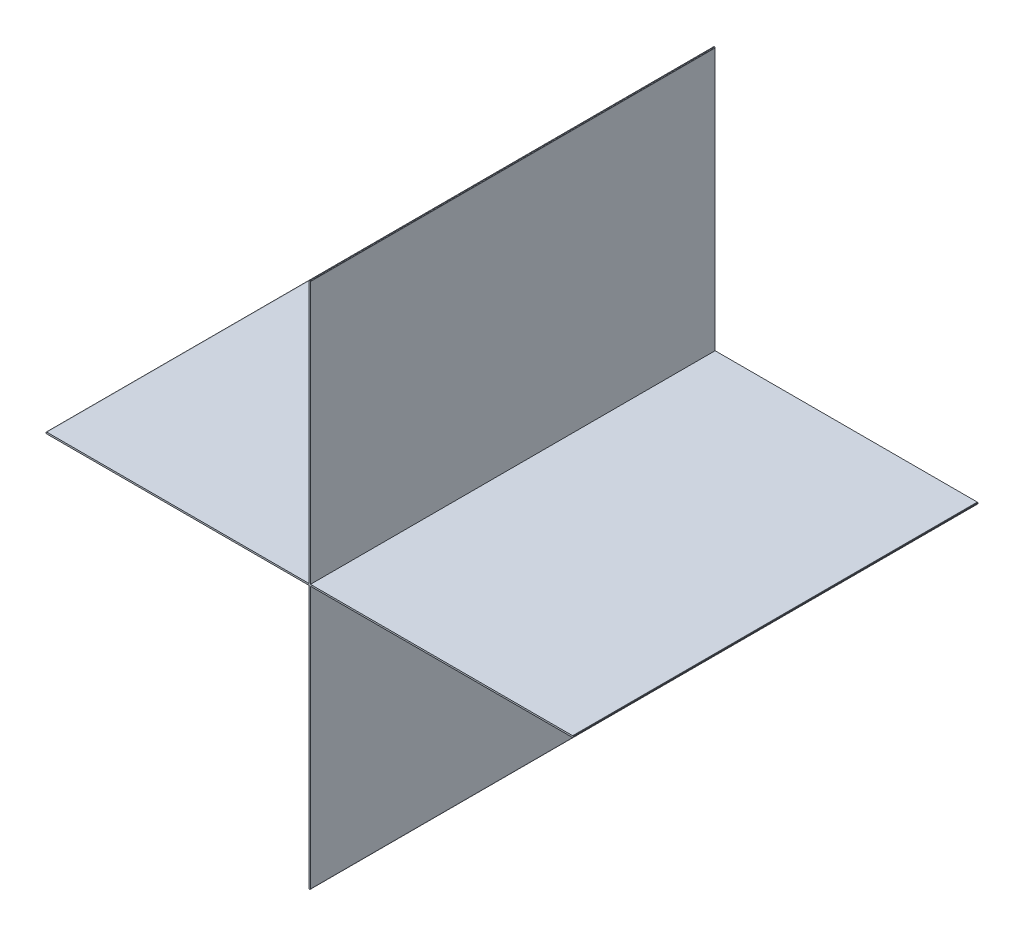
ISO-10303-21;
HEADER;
FILE_DESCRIPTION(('STEP AP214'),'2;1');
FILE_NAME('part.step','',(''),(''),'','','');
FILE_SCHEMA(('AUTOMOTIVE_DESIGN { 1 0 10303 214 1 1 1 1 }'));
ENDSEC;
DATA;
#1=APPLICATION_CONTEXT('core data for automotive mechanical design processes');
#2=APPLICATION_PROTOCOL_DEFINITION('international standard','automotive_design',2000,#1);
#3=PRODUCT_CONTEXT('',#1,'mechanical');
#4=PRODUCT('Part','Part','',(#3));
#5=PRODUCT_RELATED_PRODUCT_CATEGORY('part','',(#4));
#6=PRODUCT_DEFINITION_FORMATION('','',#4);
#7=PRODUCT_DEFINITION_CONTEXT('part definition',#1,'design');
#8=PRODUCT_DEFINITION('design','',#6,#7);
#9=PRODUCT_DEFINITION_SHAPE('','',#8);
#10=(LENGTH_UNIT() NAMED_UNIT(*) SI_UNIT(.MILLI.,.METRE.));
#11=(NAMED_UNIT(*) PLANE_ANGLE_UNIT() SI_UNIT($,.RADIAN.));
#12=(NAMED_UNIT(*) SI_UNIT($,.STERADIAN.) SOLID_ANGLE_UNIT());
#13=UNCERTAINTY_MEASURE_WITH_UNIT(LENGTH_MEASURE(1.E-05),#10,'distance_accuracy_value','');
#14=(GEOMETRIC_REPRESENTATION_CONTEXT(3) GLOBAL_UNCERTAINTY_ASSIGNED_CONTEXT((#13)) GLOBAL_UNIT_ASSIGNED_CONTEXT((#10,
#11,#12)) REPRESENTATION_CONTEXT('',''));
#15=CARTESIAN_POINT('',(0.,0.,0.));
#16=DIRECTION('',(0.,0.,1.));
#17=DIRECTION('',(1.,0.,0.));
#18=AXIS2_PLACEMENT_3D('',#15,#16,#17);
#19=CARTESIAN_POINT('',(-0.1649984,0.0005079999999964,0.));
#20=DIRECTION('',(0.,-1.,0.));
#21=DIRECTION('',(-1.,0.,0.));
#22=AXIS2_PLACEMENT_3D('',#19,#20,#21);
#23=PLANE('',#22);
#24=DIRECTION('',(-1.,0.,0.));
#25=VECTOR('',#24,1.);
#26=CARTESIAN_POINT('',(-0.1649984,0.0005079999999964,0.));
#27=LINE('',#26,#25);
#28=CARTESIAN_POINT('',(-0.1649984,0.0005079999999964,0.));
#29=VERTEX_POINT('',#28);
#30=CARTESIAN_POINT('',(-0.16520922,0.0005079999999964,0.));
#31=VERTEX_POINT('',#30);
#32=EDGE_CURVE('E11',#29,#31,#27,.T.);
#33=ORIENTED_EDGE('',*,*,#32,.T.);
#34=DIRECTION('',(0.,0.,1.));
#35=VECTOR('',#34,1.);
#36=CARTESIAN_POINT('',(-0.16520922,0.0005079999999964,0.));
#37=LINE('',#36,#35);
#38=CARTESIAN_POINT('',(-0.16520922,0.0005079999999964,0.254));
#39=VERTEX_POINT('',#38);
#40=EDGE_CURVE('E24',#31,#39,#37,.T.);
#41=ORIENTED_EDGE('',*,*,#40,.T.);
#42=DIRECTION('',(-1.,0.,0.));
#43=VECTOR('',#42,1.);
#44=CARTESIAN_POINT('',(-0.1649984,0.0005079999999964,0.254));
#45=LINE('',#44,#43);
#46=CARTESIAN_POINT('',(-0.1649984,0.0005079999999964,0.254));
#47=VERTEX_POINT('',#46);
#48=EDGE_CURVE('E494',#47,#39,#45,.T.);
#49=ORIENTED_EDGE('',*,*,#48,.F.);
#50=DIRECTION('',(0.,0.,1.));
#51=VECTOR('',#50,1.);
#52=CARTESIAN_POINT('',(-0.1649984,0.0005079999999964,0.));
#53=LINE('',#52,#51);
#54=EDGE_CURVE('E36',#29,#47,#53,.T.);
#55=ORIENTED_EDGE('',*,*,#54,.F.);
#56=EDGE_LOOP('',(#33,#41,#49,#55));
#57=FACE_BOUND('',#56,.T.);
#58=ADVANCED_FACE('F17',(#57),#23,.F.);
#59=CARTESIAN_POINT('',(-0.16520922,0.0005079999999964,0.));
#60=DIRECTION('',(0.710109317017189,-0.704091441423187,0.));
#61=DIRECTION('',(-0.704091441423187,-0.710109317017189,0.));
#62=AXIS2_PLACEMENT_3D('',#59,#60,#61);
#63=PLANE('',#62);
#64=DIRECTION('',(-0.704091441423187,-0.710109317017189,0.));
#65=VECTOR('',#64,1.);
#66=CARTESIAN_POINT('',(-0.16520922,0.0005079999999964,0.));
#67=LINE('',#66,#65);
#68=CARTESIAN_POINT('',(-0.1655064,0.0002082799999954,0.));
#69=VERTEX_POINT('',#68);
#70=EDGE_CURVE('E491',#31,#69,#67,.T.);
#71=ORIENTED_EDGE('',*,*,#70,.T.);
#72=DIRECTION('',(0.,0.,1.));
#73=VECTOR('',#72,1.);
#74=CARTESIAN_POINT('',(-0.1655064,0.0002082799999954,0.));
#75=LINE('',#74,#73);
#76=CARTESIAN_POINT('',(-0.1655064,0.0002082799999954,0.254));
#77=VERTEX_POINT('',#76);
#78=EDGE_CURVE('E488',#69,#77,#75,.T.);
#79=ORIENTED_EDGE('',*,*,#78,.T.);
#80=DIRECTION('',(-0.704091441423187,-0.710109317017189,0.));
#81=VECTOR('',#80,1.);
#82=CARTESIAN_POINT('',(-0.16520922,0.0005079999999964,0.254));
#83=LINE('',#82,#81);
#84=EDGE_CURVE('E486',#39,#77,#83,.T.);
#85=ORIENTED_EDGE('',*,*,#84,.F.);
#86=ORIENTED_EDGE('',*,*,#40,.F.);
#87=EDGE_LOOP('',(#71,#79,#85,#86));
#88=FACE_BOUND('',#87,.T.);
#89=ADVANCED_FACE('F496',(#88),#63,.F.);
#90=CARTESIAN_POINT('',(-0.1655064,0.0002082799999954,0.));
#91=DIRECTION('',(1.,0.,0.));
#92=DIRECTION('',(0.,-1.,0.));
#93=AXIS2_PLACEMENT_3D('',#90,#91,#92);
#94=PLANE('',#93);
#95=DIRECTION('',(0.,-1.,0.));
#96=VECTOR('',#95,1.);
#97=CARTESIAN_POINT('',(-0.1655064,0.0002082799999954,0.));
#98=LINE('',#97,#96);
#99=CARTESIAN_POINT('',(-0.1655064,-0.0002108200000031,0.));
#100=VERTEX_POINT('',#99);
#101=EDGE_CURVE('E483',#69,#100,#98,.T.);
#102=ORIENTED_EDGE('',*,*,#101,.T.);
#103=DIRECTION('',(0.,0.,1.));
#104=VECTOR('',#103,1.);
#105=CARTESIAN_POINT('',(-0.1655064,-0.0002108200000031,0.));
#106=LINE('',#105,#104);
#107=CARTESIAN_POINT('',(-0.1655064,-0.0002108200000031,0.254));
#108=VERTEX_POINT('',#107);
#109=EDGE_CURVE('E480',#100,#108,#106,.T.);
#110=ORIENTED_EDGE('',*,*,#109,.T.);
#111=DIRECTION('',(0.,-1.,0.));
#112=VECTOR('',#111,1.);
#113=CARTESIAN_POINT('',(-0.1655064,0.0002082799999954,0.254));
#114=LINE('',#113,#112);
#115=EDGE_CURVE('E478',#77,#108,#114,.T.);
#116=ORIENTED_EDGE('',*,*,#115,.F.);
#117=ORIENTED_EDGE('',*,*,#78,.F.);
#118=EDGE_LOOP('',(#102,#110,#116,#117));
#119=FACE_BOUND('',#118,.T.);
#120=ADVANCED_FACE('F500',(#119),#94,.F.);
#121=CARTESIAN_POINT('',(-0.1655064,-0.0002108200000031,0.));
#122=DIRECTION('',(0.707106781199048,0.707106781174048,0.));
#123=DIRECTION('',(0.707106781174048,-0.707106781199048,0.));
#124=AXIS2_PLACEMENT_3D('',#121,#122,#123);
#125=PLANE('',#124);
#126=DIRECTION('',(0.707106781174048,-0.707106781199048,0.));
#127=VECTOR('',#126,1.);
#128=CARTESIAN_POINT('',(-0.1655064,-0.0002108200000031,0.));
#129=LINE('',#128,#127);
#130=CARTESIAN_POINT('',(-0.16520922,-0.0005080000000035,0.));
#131=VERTEX_POINT('',#130);
#132=EDGE_CURVE('E475',#100,#131,#129,.T.);
#133=ORIENTED_EDGE('',*,*,#132,.T.);
#134=DIRECTION('',(0.,0.,1.));
#135=VECTOR('',#134,1.);
#136=CARTESIAN_POINT('',(-0.16520922,-0.0005080000000035,0.));
#137=LINE('',#136,#135);
#138=CARTESIAN_POINT('',(-0.16520922,-0.0005080000000035,0.254));
#139=VERTEX_POINT('',#138);
#140=EDGE_CURVE('E472',#131,#139,#137,.T.);
#141=ORIENTED_EDGE('',*,*,#140,.T.);
#142=DIRECTION('',(0.707106781174048,-0.707106781199048,0.));
#143=VECTOR('',#142,1.);
#144=CARTESIAN_POINT('',(-0.1655064,-0.0002108200000031,0.254));
#145=LINE('',#144,#143);
#146=EDGE_CURVE('E470',#108,#139,#145,.T.);
#147=ORIENTED_EDGE('',*,*,#146,.F.);
#148=ORIENTED_EDGE('',*,*,#109,.F.);
#149=EDGE_LOOP('',(#133,#141,#147,#148));
#150=FACE_BOUND('',#149,.T.);
#151=ADVANCED_FACE('F504',(#150),#125,.F.);
#152=CARTESIAN_POINT('',(-0.16520922,-0.0005080000000035,0.));
#153=DIRECTION('',(0.,1.,0.));
#154=DIRECTION('',(1.,0.,0.));
#155=AXIS2_PLACEMENT_3D('',#152,#153,#154);
#156=PLANE('',#155);
#157=DIRECTION('',(1.,0.,0.));
#158=VECTOR('',#157,1.);
#159=CARTESIAN_POINT('',(-0.16520922,-0.0005080000000035,0.));
#160=LINE('',#159,#158);
#161=CARTESIAN_POINT('',(-0.1649984,-0.0005080000000035,0.));
#162=VERTEX_POINT('',#161);
#163=EDGE_CURVE('E467',#131,#162,#160,.T.);
#164=ORIENTED_EDGE('',*,*,#163,.T.);
#165=DIRECTION('',(0.,0.,1.));
#166=VECTOR('',#165,1.);
#167=CARTESIAN_POINT('',(-0.1649984,-0.0005080000000035,0.));
#168=LINE('',#167,#166);
#169=CARTESIAN_POINT('',(-0.1649984,-0.0005080000000035,0.254));
#170=VERTEX_POINT('',#169);
#171=EDGE_CURVE('E464',#162,#170,#168,.T.);
#172=ORIENTED_EDGE('',*,*,#171,.T.);
#173=DIRECTION('',(1.,0.,0.));
#174=VECTOR('',#173,1.);
#175=CARTESIAN_POINT('',(-0.16520922,-0.0005080000000035,0.254));
#176=LINE('',#175,#174);
#177=EDGE_CURVE('E462',#139,#170,#176,.T.);
#178=ORIENTED_EDGE('',*,*,#177,.F.);
#179=ORIENTED_EDGE('',*,*,#140,.F.);
#180=EDGE_LOOP('',(#164,#172,#178,#179));
#181=FACE_BOUND('',#180,.T.);
#182=ADVANCED_FACE('F508',(#181),#156,.F.);
#183=CARTESIAN_POINT('',(-0.1649984,-0.0005080000000035,0.));
#184=DIRECTION('',(0.,1.,0.));
#185=DIRECTION('',(1.,0.,0.));
#186=AXIS2_PLACEMENT_3D('',#183,#184,#185);
#187=PLANE('',#186);
#188=DIRECTION('',(1.,0.,0.));
#189=VECTOR('',#188,1.);
#190=CARTESIAN_POINT('',(-0.1649984,-0.0005080000000035,0.));
#191=LINE('',#190,#189);
#192=CARTESIAN_POINT('',(-0.0005080000000106,-0.0005080000000035,0.));
#193=VERTEX_POINT('',#192);
#194=EDGE_CURVE('E459',#162,#193,#191,.T.);
#195=ORIENTED_EDGE('',*,*,#194,.T.);
#196=DIRECTION('',(0.,0.,1.));
#197=VECTOR('',#196,1.);
#198=CARTESIAN_POINT('',(-0.0005080000000106,-0.0005080000000035,0.));
#199=LINE('',#198,#197);
#200=CARTESIAN_POINT('',(-0.0005080000000106,-0.0005080000000035,0.254));
#201=VERTEX_POINT('',#200);
#202=EDGE_CURVE('E456',#193,#201,#199,.T.);
#203=ORIENTED_EDGE('',*,*,#202,.T.);
#204=DIRECTION('',(1.,0.,0.));
#205=VECTOR('',#204,1.);
#206=CARTESIAN_POINT('',(-0.1649984,-0.0005080000000035,0.254));
#207=LINE('',#206,#205);
#208=EDGE_CURVE('E454',#170,#201,#207,.T.);
#209=ORIENTED_EDGE('',*,*,#208,.F.);
#210=ORIENTED_EDGE('',*,*,#171,.F.);
#211=EDGE_LOOP('',(#195,#203,#209,#210));
#212=FACE_BOUND('',#211,.T.);
#213=ADVANCED_FACE('F512',(#212),#187,.F.);
#214=CARTESIAN_POINT('',(-0.0005080000000106,-0.0005080000000035,0.));
#215=DIRECTION('',(1.,0.,0.));
#216=DIRECTION('',(0.,-1.,0.));
#217=AXIS2_PLACEMENT_3D('',#214,#215,#216);
#218=PLANE('',#217);
#219=DIRECTION('',(0.,-1.,0.));
#220=VECTOR('',#219,1.);
#221=CARTESIAN_POINT('',(-0.0005080000000106,-0.0005080000000035,0.));
#222=LINE('',#221,#220);
#223=CARTESIAN_POINT('',(-0.0005080000000106,-0.16500094,0.));
#224=VERTEX_POINT('',#223);
#225=EDGE_CURVE('E451',#193,#224,#222,.T.);
#226=ORIENTED_EDGE('',*,*,#225,.T.);
#227=DIRECTION('',(0.,0.,1.));
#228=VECTOR('',#227,1.);
#229=CARTESIAN_POINT('',(-0.0005080000000106,-0.16500094,0.));
#230=LINE('',#229,#228);
#231=CARTESIAN_POINT('',(-0.0005080000000106,-0.16500094,0.254));
#232=VERTEX_POINT('',#231);
#233=EDGE_CURVE('E448',#224,#232,#230,.T.);
#234=ORIENTED_EDGE('',*,*,#233,.T.);
#235=DIRECTION('',(0.,-1.,0.));
#236=VECTOR('',#235,1.);
#237=CARTESIAN_POINT('',(-0.0005080000000106,-0.0005080000000035,0.254));
#238=LINE('',#237,#236);
#239=EDGE_CURVE('E446',#201,#232,#238,.T.);
#240=ORIENTED_EDGE('',*,*,#239,.F.);
#241=ORIENTED_EDGE('',*,*,#202,.F.);
#242=EDGE_LOOP('',(#226,#234,#240,#241));
#243=FACE_BOUND('',#242,.T.);
#244=ADVANCED_FACE('F516',(#243),#218,.F.);
#245=CARTESIAN_POINT('',(-0.0005080000000106,-0.16500094,0.));
#246=DIRECTION('',(1.,0.,0.));
#247=DIRECTION('',(0.,-1.,0.));
#248=AXIS2_PLACEMENT_3D('',#245,#246,#247);
#249=PLANE('',#248);
#250=DIRECTION('',(0.,-1.,0.));
#251=VECTOR('',#250,1.);
#252=CARTESIAN_POINT('',(-0.0005080000000106,-0.16500094,0.));
#253=LINE('',#252,#251);
#254=CARTESIAN_POINT('',(-0.0005080000000106,-0.16521176,0.));
#255=VERTEX_POINT('',#254);
#256=EDGE_CURVE('E443',#224,#255,#253,.T.);
#257=ORIENTED_EDGE('',*,*,#256,.T.);
#258=DIRECTION('',(0.,0.,1.));
#259=VECTOR('',#258,1.);
#260=CARTESIAN_POINT('',(-0.0005080000000106,-0.16521176,0.));
#261=LINE('',#260,#259);
#262=CARTESIAN_POINT('',(-0.0005080000000106,-0.16521176,0.254));
#263=VERTEX_POINT('',#262);
#264=EDGE_CURVE('E440',#255,#263,#261,.T.);
#265=ORIENTED_EDGE('',*,*,#264,.T.);
#266=DIRECTION('',(0.,-1.,0.));
#267=VECTOR('',#266,1.);
#268=CARTESIAN_POINT('',(-0.0005080000000106,-0.16500094,0.254));
#269=LINE('',#268,#267);
#270=EDGE_CURVE('E438',#232,#263,#269,.T.);
#271=ORIENTED_EDGE('',*,*,#270,.F.);
#272=ORIENTED_EDGE('',*,*,#233,.F.);
#273=EDGE_LOOP('',(#257,#265,#271,#272));
#274=FACE_BOUND('',#273,.T.);
#275=ADVANCED_FACE('F520',(#274),#249,.F.);
#276=CARTESIAN_POINT('',(-0.0005080000000106,-0.16521176,0.));
#277=DIRECTION('',(0.707106781161048,0.707106781212048,0.));
#278=DIRECTION('',(0.707106781212048,-0.707106781161048,0.));
#279=AXIS2_PLACEMENT_3D('',#276,#277,#278);
#280=PLANE('',#279);
#281=DIRECTION('',(0.707106781212048,-0.707106781161048,0.));
#282=VECTOR('',#281,1.);
#283=CARTESIAN_POINT('',(-0.0005080000000106,-0.16521176,0.));
#284=LINE('',#283,#282);
#285=CARTESIAN_POINT('',(-0.0002108199999924,-0.16550894,0.));
#286=VERTEX_POINT('',#285);
#287=EDGE_CURVE('E435',#255,#286,#284,.T.);
#288=ORIENTED_EDGE('',*,*,#287,.T.);
#289=DIRECTION('',(0.,0.,1.));
#290=VECTOR('',#289,1.);
#291=CARTESIAN_POINT('',(-0.0002108199999924,-0.16550894,0.));
#292=LINE('',#291,#290);
#293=CARTESIAN_POINT('',(-0.0002108199999924,-0.16550894,0.254));
#294=VERTEX_POINT('',#293);
#295=EDGE_CURVE('E432',#286,#294,#292,.T.);
#296=ORIENTED_EDGE('',*,*,#295,.T.);
#297=DIRECTION('',(0.707106781212048,-0.707106781161048,0.));
#298=VECTOR('',#297,1.);
#299=CARTESIAN_POINT('',(-0.0005080000000106,-0.16521176,0.254));
#300=LINE('',#299,#298);
#301=EDGE_CURVE('E430',#263,#294,#300,.T.);
#302=ORIENTED_EDGE('',*,*,#301,.F.);
#303=ORIENTED_EDGE('',*,*,#264,.F.);
#304=EDGE_LOOP('',(#288,#296,#302,#303));
#305=FACE_BOUND('',#304,.T.);
#306=ADVANCED_FACE('F524',(#305),#280,.F.);
#307=CARTESIAN_POINT('',(-0.0002108199999924,-0.16550894,0.));
#308=DIRECTION('',(0.,1.,0.));
#309=DIRECTION('',(1.,0.,0.));
#310=AXIS2_PLACEMENT_3D('',#307,#308,#309);
#311=PLANE('',#310);
#312=DIRECTION('',(1.,0.,0.));
#313=VECTOR('',#312,1.);
#314=CARTESIAN_POINT('',(-0.0002108199999924,-0.16550894,0.));
#315=LINE('',#314,#313);
#316=CARTESIAN_POINT('',(0.0002082799999954,-0.16550894,0.));
#317=VERTEX_POINT('',#316);
#318=EDGE_CURVE('E427',#286,#317,#315,.T.);
#319=ORIENTED_EDGE('',*,*,#318,.T.);
#320=DIRECTION('',(0.,0.,1.));
#321=VECTOR('',#320,1.);
#322=CARTESIAN_POINT('',(0.0002082799999954,-0.16550894,0.));
#323=LINE('',#322,#321);
#324=CARTESIAN_POINT('',(0.0002082799999954,-0.16550894,0.254));
#325=VERTEX_POINT('',#324);
#326=EDGE_CURVE('E424',#317,#325,#323,.T.);
#327=ORIENTED_EDGE('',*,*,#326,.T.);
#328=DIRECTION('',(1.,0.,0.));
#329=VECTOR('',#328,1.);
#330=CARTESIAN_POINT('',(-0.0002108199999924,-0.16550894,0.254));
#331=LINE('',#330,#329);
#332=EDGE_CURVE('E422',#294,#325,#331,.T.);
#333=ORIENTED_EDGE('',*,*,#332,.F.);
#334=ORIENTED_EDGE('',*,*,#295,.F.);
#335=EDGE_LOOP('',(#319,#327,#333,#334));
#336=FACE_BOUND('',#335,.T.);
#337=ADVANCED_FACE('F528',(#336),#311,.F.);
#338=CARTESIAN_POINT('',(0.0002082799999954,-0.16550894,0.));
#339=DIRECTION('',(-0.704091441414653,0.71010931702565,0.));
#340=DIRECTION('',(0.71010931702565,0.704091441414653,0.));
#341=AXIS2_PLACEMENT_3D('',#338,#339,#340);
#342=PLANE('',#341);
#343=DIRECTION('',(0.71010931702565,0.704091441414653,0.));
#344=VECTOR('',#343,1.);
#345=CARTESIAN_POINT('',(0.0002082799999954,-0.16550894,0.));
#346=LINE('',#345,#344);
#347=CARTESIAN_POINT('',(0.0005080000000106,-0.16521176,0.));
#348=VERTEX_POINT('',#347);
#349=EDGE_CURVE('E419',#317,#348,#346,.T.);
#350=ORIENTED_EDGE('',*,*,#349,.T.);
#351=DIRECTION('',(0.,0.,1.));
#352=VECTOR('',#351,1.);
#353=CARTESIAN_POINT('',(0.0005080000000106,-0.16521176,0.));
#354=LINE('',#353,#352);
#355=CARTESIAN_POINT('',(0.0005080000000106,-0.16521176,0.254));
#356=VERTEX_POINT('',#355);
#357=EDGE_CURVE('E416',#348,#356,#354,.T.);
#358=ORIENTED_EDGE('',*,*,#357,.T.);
#359=DIRECTION('',(0.71010931702565,0.704091441414653,0.));
#360=VECTOR('',#359,1.);
#361=CARTESIAN_POINT('',(0.0002082799999954,-0.16550894,0.254));
#362=LINE('',#361,#360);
#363=EDGE_CURVE('E414',#325,#356,#362,.T.);
#364=ORIENTED_EDGE('',*,*,#363,.F.);
#365=ORIENTED_EDGE('',*,*,#326,.F.);
#366=EDGE_LOOP('',(#350,#358,#364,#365));
#367=FACE_BOUND('',#366,.T.);
#368=ADVANCED_FACE('F532',(#367),#342,.F.);
#369=CARTESIAN_POINT('',(0.0005080000000106,-0.16521176,0.));
#370=DIRECTION('',(-1.,0.,0.));
#371=DIRECTION('',(0.,1.,0.));
#372=AXIS2_PLACEMENT_3D('',#369,#370,#371);
#373=PLANE('',#372);
#374=DIRECTION('',(0.,1.,0.));
#375=VECTOR('',#374,1.);
#376=CARTESIAN_POINT('',(0.0005080000000106,-0.16521176,0.));
#377=LINE('',#376,#375);
#378=CARTESIAN_POINT('',(0.0005080000000106,-0.16500094,0.));
#379=VERTEX_POINT('',#378);
#380=EDGE_CURVE('E411',#348,#379,#377,.T.);
#381=ORIENTED_EDGE('',*,*,#380,.T.);
#382=DIRECTION('',(0.,0.,1.));
#383=VECTOR('',#382,1.);
#384=CARTESIAN_POINT('',(0.0005080000000106,-0.16500094,0.));
#385=LINE('',#384,#383);
#386=CARTESIAN_POINT('',(0.0005080000000106,-0.16500094,0.254));
#387=VERTEX_POINT('',#386);
#388=EDGE_CURVE('E408',#379,#387,#385,.T.);
#389=ORIENTED_EDGE('',*,*,#388,.T.);
#390=DIRECTION('',(0.,1.,0.));
#391=VECTOR('',#390,1.);
#392=CARTESIAN_POINT('',(0.0005080000000106,-0.16521176,0.254));
#393=LINE('',#392,#391);
#394=EDGE_CURVE('E406',#356,#387,#393,.T.);
#395=ORIENTED_EDGE('',*,*,#394,.F.);
#396=ORIENTED_EDGE('',*,*,#357,.F.);
#397=EDGE_LOOP('',(#381,#389,#395,#396));
#398=FACE_BOUND('',#397,.T.);
#399=ADVANCED_FACE('F536',(#398),#373,.F.);
#400=CARTESIAN_POINT('',(0.0005080000000106,-0.16500094,0.));
#401=DIRECTION('',(-1.,0.,0.));
#402=DIRECTION('',(0.,1.,0.));
#403=AXIS2_PLACEMENT_3D('',#400,#401,#402);
#404=PLANE('',#403);
#405=DIRECTION('',(0.,1.,0.));
#406=VECTOR('',#405,1.);
#407=CARTESIAN_POINT('',(0.0005080000000106,-0.16500094,0.));
#408=LINE('',#407,#406);
#409=CARTESIAN_POINT('',(0.0005080000000106,-0.0005080000000035,0.));
#410=VERTEX_POINT('',#409);
#411=EDGE_CURVE('E403',#379,#410,#408,.T.);
#412=ORIENTED_EDGE('',*,*,#411,.T.);
#413=DIRECTION('',(0.,0.,1.));
#414=VECTOR('',#413,1.);
#415=CARTESIAN_POINT('',(0.0005080000000106,-0.0005080000000035,0.));
#416=LINE('',#415,#414);
#417=CARTESIAN_POINT('',(0.0005080000000106,-0.0005080000000035,0.254));
#418=VERTEX_POINT('',#417);
#419=EDGE_CURVE('E400',#410,#418,#416,.T.);
#420=ORIENTED_EDGE('',*,*,#419,.T.);
#421=DIRECTION('',(0.,1.,0.));
#422=VECTOR('',#421,1.);
#423=CARTESIAN_POINT('',(0.0005080000000106,-0.16500094,0.254));
#424=LINE('',#423,#422);
#425=EDGE_CURVE('E398',#387,#418,#424,.T.);
#426=ORIENTED_EDGE('',*,*,#425,.F.);
#427=ORIENTED_EDGE('',*,*,#388,.F.);
#428=EDGE_LOOP('',(#412,#420,#426,#427));
#429=FACE_BOUND('',#428,.T.);
#430=ADVANCED_FACE('F540',(#429),#404,.F.);
#431=CARTESIAN_POINT('',(0.0005080000000106,-0.0005080000000035,0.));
#432=DIRECTION('',(0.,1.,0.));
#433=DIRECTION('',(1.,0.,0.));
#434=AXIS2_PLACEMENT_3D('',#431,#432,#433);
#435=PLANE('',#434);
#436=DIRECTION('',(1.,0.,0.));
#437=VECTOR('',#436,1.);
#438=CARTESIAN_POINT('',(0.0005080000000106,-0.0005080000000035,0.));
#439=LINE('',#438,#437);
#440=CARTESIAN_POINT('',(0.16500094,-0.0005080000000035,0.));
#441=VERTEX_POINT('',#440);
#442=EDGE_CURVE('E395',#410,#441,#439,.T.);
#443=ORIENTED_EDGE('',*,*,#442,.T.);
#444=DIRECTION('',(0.,0.,1.));
#445=VECTOR('',#444,1.);
#446=CARTESIAN_POINT('',(0.16500094,-0.0005080000000035,0.));
#447=LINE('',#446,#445);
#448=CARTESIAN_POINT('',(0.16500094,-0.0005080000000035,0.254));
#449=VERTEX_POINT('',#448);
#450=EDGE_CURVE('E392',#441,#449,#447,.T.);
#451=ORIENTED_EDGE('',*,*,#450,.T.);
#452=DIRECTION('',(1.,0.,0.));
#453=VECTOR('',#452,1.);
#454=CARTESIAN_POINT('',(0.0005080000000106,-0.0005080000000035,0.254));
#455=LINE('',#454,#453);
#456=EDGE_CURVE('E390',#418,#449,#455,.T.);
#457=ORIENTED_EDGE('',*,*,#456,.F.);
#458=ORIENTED_EDGE('',*,*,#419,.F.);
#459=EDGE_LOOP('',(#443,#451,#457,#458));
#460=FACE_BOUND('',#459,.T.);
#461=ADVANCED_FACE('F544',(#460),#435,.F.);
#462=CARTESIAN_POINT('',(0.16500094,-0.0005080000000035,0.));
#463=DIRECTION('',(0.,1.,0.));
#464=DIRECTION('',(1.,0.,0.));
#465=AXIS2_PLACEMENT_3D('',#462,#463,#464);
#466=PLANE('',#465);
#467=DIRECTION('',(1.,0.,0.));
#468=VECTOR('',#467,1.);
#469=CARTESIAN_POINT('',(0.16500094,-0.0005080000000035,0.));
#470=LINE('',#469,#468);
#471=CARTESIAN_POINT('',(0.1651,-0.0005080000000035,0.));
#472=VERTEX_POINT('',#471);
#473=EDGE_CURVE('E387',#441,#472,#470,.T.);
#474=ORIENTED_EDGE('',*,*,#473,.T.);
#475=DIRECTION('',(0.,0.,1.));
#476=VECTOR('',#475,1.);
#477=CARTESIAN_POINT('',(0.1651,-0.0005080000000035,0.));
#478=LINE('',#477,#476);
#479=CARTESIAN_POINT('',(0.1651,-0.0005080000000035,0.254));
#480=VERTEX_POINT('',#479);
#481=EDGE_CURVE('E384',#472,#480,#478,.T.);
#482=ORIENTED_EDGE('',*,*,#481,.T.);
#483=DIRECTION('',(1.,0.,0.));
#484=VECTOR('',#483,1.);
#485=CARTESIAN_POINT('',(0.16500094,-0.0005080000000035,0.254));
#486=LINE('',#485,#484);
#487=EDGE_CURVE('E382',#449,#480,#486,.T.);
#488=ORIENTED_EDGE('',*,*,#487,.F.);
#489=ORIENTED_EDGE('',*,*,#450,.F.);
#490=EDGE_LOOP('',(#474,#482,#488,#489));
#491=FACE_BOUND('',#490,.T.);
#492=ADVANCED_FACE('F548',(#491),#466,.F.);
#493=CARTESIAN_POINT('',(0.1651,-0.0005080000000035,0.));
#494=DIRECTION('',(-0.375705108700965,0.926739268238913,0.));
#495=DIRECTION('',(0.926739268238913,0.375705108700965,0.));
#496=AXIS2_PLACEMENT_3D('',#493,#494,#495);
#497=PLANE('',#496);
#498=DIRECTION('',(0.926739268238913,0.375705108700965,0.));
#499=VECTOR('',#498,1.);
#500=CARTESIAN_POINT('',(0.1651,-0.0005080000000035,0.));
#501=LINE('',#500,#499);
#502=CARTESIAN_POINT('',(0.16528796,-0.0004318000000048,0.));
#503=VERTEX_POINT('',#502);
#504=EDGE_CURVE('E379',#472,#503,#501,.T.);
#505=ORIENTED_EDGE('',*,*,#504,.T.);
#506=DIRECTION('',(0.,0.,1.));
#507=VECTOR('',#506,1.);
#508=CARTESIAN_POINT('',(0.16528796,-0.0004318000000048,0.));
#509=LINE('',#508,#507);
#510=CARTESIAN_POINT('',(0.16528796,-0.0004318000000048,0.254));
#511=VERTEX_POINT('',#510);
#512=EDGE_CURVE('E376',#503,#511,#509,.T.);
#513=ORIENTED_EDGE('',*,*,#512,.T.);
#514=DIRECTION('',(0.926739268238913,0.375705108700965,0.));
#515=VECTOR('',#514,1.);
#516=CARTESIAN_POINT('',(0.1651,-0.0005080000000035,0.254));
#517=LINE('',#516,#515);
#518=EDGE_CURVE('E374',#480,#511,#517,.T.);
#519=ORIENTED_EDGE('',*,*,#518,.F.);
#520=ORIENTED_EDGE('',*,*,#481,.F.);
#521=EDGE_LOOP('',(#505,#513,#519,#520));
#522=FACE_BOUND('',#521,.T.);
#523=ADVANCED_FACE('F552',(#522),#497,.F.);
#524=CARTESIAN_POINT('',(0.16528796,-0.0004318000000048,0.));
#525=DIRECTION('',(-0.707106781266048,0.707106781107047,0.));
#526=DIRECTION('',(0.707106781107047,0.707106781266048,0.));
#527=AXIS2_PLACEMENT_3D('',#524,#525,#526);
#528=PLANE('',#527);
#529=DIRECTION('',(0.707106781107047,0.707106781266048,0.));
#530=VECTOR('',#529,1.);
#531=CARTESIAN_POINT('',(0.16528796,-0.0004318000000048,0.));
#532=LINE('',#531,#530);
#533=CARTESIAN_POINT('',(0.1654302,-0.0002895599999988,0.));
#534=VERTEX_POINT('',#533);
#535=EDGE_CURVE('E371',#503,#534,#532,.T.);
#536=ORIENTED_EDGE('',*,*,#535,.T.);
#537=DIRECTION('',(0.,0.,1.));
#538=VECTOR('',#537,1.);
#539=CARTESIAN_POINT('',(0.1654302,-0.0002895599999988,0.));
#540=LINE('',#539,#538);
#541=CARTESIAN_POINT('',(0.1654302,-0.0002895599999988,0.254));
#542=VERTEX_POINT('',#541);
#543=EDGE_CURVE('E368',#534,#542,#540,.T.);
#544=ORIENTED_EDGE('',*,*,#543,.T.);
#545=DIRECTION('',(0.707106781107047,0.707106781266048,0.));
#546=VECTOR('',#545,1.);
#547=CARTESIAN_POINT('',(0.16528796,-0.0004318000000048,0.254));
#548=LINE('',#547,#546);
#549=EDGE_CURVE('E366',#511,#542,#548,.T.);
#550=ORIENTED_EDGE('',*,*,#549,.F.);
#551=ORIENTED_EDGE('',*,*,#512,.F.);
#552=EDGE_LOOP('',(#536,#544,#550,#551));
#553=FACE_BOUND('',#552,.T.);
#554=ADVANCED_FACE('F556',(#553),#528,.F.);
#555=CARTESIAN_POINT('',(0.1654302,-0.0002895599999988,0.));
#556=DIRECTION('',(-0.922337709840803,0.386384716319917,0.));
#557=DIRECTION('',(0.386384716319917,0.922337709840803,0.));
#558=AXIS2_PLACEMENT_3D('',#555,#556,#557);
#559=PLANE('',#558);
#560=DIRECTION('',(0.386384716319917,0.922337709840803,0.));
#561=VECTOR('',#560,1.);
#562=CARTESIAN_POINT('',(0.1654302,-0.0002895599999988,0.));
#563=LINE('',#562,#561);
#564=CARTESIAN_POINT('',(0.16550894,-0.0001016000000007,0.));
#565=VERTEX_POINT('',#564);
#566=EDGE_CURVE('E363',#534,#565,#563,.T.);
#567=ORIENTED_EDGE('',*,*,#566,.T.);
#568=DIRECTION('',(0.,0.,1.));
#569=VECTOR('',#568,1.);
#570=CARTESIAN_POINT('',(0.16550894,-0.0001016000000007,0.));
#571=LINE('',#570,#569);
#572=CARTESIAN_POINT('',(0.16550894,-0.0001016000000007,0.254));
#573=VERTEX_POINT('',#572);
#574=EDGE_CURVE('E360',#565,#573,#571,.T.);
#575=ORIENTED_EDGE('',*,*,#574,.T.);
#576=DIRECTION('',(0.386384716319917,0.922337709840803,0.));
#577=VECTOR('',#576,1.);
#578=CARTESIAN_POINT('',(0.1654302,-0.0002895599999988,0.254));
#579=LINE('',#578,#577);
#580=EDGE_CURVE('E358',#542,#573,#579,.T.);
#581=ORIENTED_EDGE('',*,*,#580,.F.);
#582=ORIENTED_EDGE('',*,*,#543,.F.);
#583=EDGE_LOOP('',(#567,#575,#581,#582));
#584=FACE_BOUND('',#583,.T.);
#585=ADVANCED_FACE('F560',(#584),#559,.F.);
#586=CARTESIAN_POINT('',(0.16550894,-0.0001016000000007,0.));
#587=DIRECTION('',(-1.,0.,0.));
#588=DIRECTION('',(0.,1.,0.));
#589=AXIS2_PLACEMENT_3D('',#586,#587,#588);
#590=PLANE('',#589);
#591=DIRECTION('',(0.,1.,0.));
#592=VECTOR('',#591,1.);
#593=CARTESIAN_POINT('',(0.16550894,-0.0001016000000007,0.));
#594=LINE('',#593,#592);
#595=CARTESIAN_POINT('',(0.16550894,0.,0.));
#596=VERTEX_POINT('',#595);
#597=EDGE_CURVE('E355',#565,#596,#594,.T.);
#598=ORIENTED_EDGE('',*,*,#597,.T.);
#599=DIRECTION('',(0.,0.,1.));
#600=VECTOR('',#599,1.);
#601=CARTESIAN_POINT('',(0.16550894,0.,0.));
#602=LINE('',#601,#600);
#603=CARTESIAN_POINT('',(0.16550894,0.,0.254));
#604=VERTEX_POINT('',#603);
#605=EDGE_CURVE('E352',#596,#604,#602,.T.);
#606=ORIENTED_EDGE('',*,*,#605,.T.);
#607=DIRECTION('',(0.,1.,0.));
#608=VECTOR('',#607,1.);
#609=CARTESIAN_POINT('',(0.16550894,-0.0001016000000007,0.254));
#610=LINE('',#609,#608);
#611=EDGE_CURVE('E350',#573,#604,#610,.T.);
#612=ORIENTED_EDGE('',*,*,#611,.F.);
#613=ORIENTED_EDGE('',*,*,#574,.F.);
#614=EDGE_LOOP('',(#598,#606,#612,#613));
#615=FACE_BOUND('',#614,.T.);
#616=ADVANCED_FACE('F564',(#615),#590,.F.);
#617=CARTESIAN_POINT('',(0.16550894,0.,0.));
#618=DIRECTION('',(-1.,0.,0.));
#619=DIRECTION('',(0.,1.,0.));
#620=AXIS2_PLACEMENT_3D('',#617,#618,#619);
#621=PLANE('',#620);
#622=DIRECTION('',(0.,1.,0.));
#623=VECTOR('',#622,1.);
#624=CARTESIAN_POINT('',(0.16550894,0.,0.));
#625=LINE('',#624,#623);
#626=CARTESIAN_POINT('',(0.16550894,9.90599999966E-05,0.));
#627=VERTEX_POINT('',#626);
#628=EDGE_CURVE('E347',#596,#627,#625,.T.);
#629=ORIENTED_EDGE('',*,*,#628,.T.);
#630=DIRECTION('',(0.,0.,1.));
#631=VECTOR('',#630,1.);
#632=CARTESIAN_POINT('',(0.16550894,9.90599999966E-05,0.));
#633=LINE('',#632,#631);
#634=CARTESIAN_POINT('',(0.16550894,9.90599999966E-05,0.254));
#635=VERTEX_POINT('',#634);
#636=EDGE_CURVE('E344',#627,#635,#633,.T.);
#637=ORIENTED_EDGE('',*,*,#636,.T.);
#638=DIRECTION('',(0.,1.,0.));
#639=VECTOR('',#638,1.);
#640=CARTESIAN_POINT('',(0.16550894,0.,0.254));
#641=LINE('',#640,#639);
#642=EDGE_CURVE('E342',#604,#635,#641,.T.);
#643=ORIENTED_EDGE('',*,*,#642,.F.);
#644=ORIENTED_EDGE('',*,*,#605,.F.);
#645=EDGE_LOOP('',(#629,#637,#643,#644));
#646=FACE_BOUND('',#645,.T.);
#647=ADVANCED_FACE('F568',(#646),#621,.F.);
#648=CARTESIAN_POINT('',(0.16550894,9.90599999966E-05,0.));
#649=DIRECTION('',(-0.92233770984324,-0.3863847163141,0.));
#650=DIRECTION('',(-0.3863847163141,0.92233770984324,0.));
#651=AXIS2_PLACEMENT_3D('',#648,#649,#650);
#652=PLANE('',#651);
#653=DIRECTION('',(-0.3863847163141,0.92233770984324,0.));
#654=VECTOR('',#653,1.);
#655=CARTESIAN_POINT('',(0.16550894,9.90599999966E-05,0.));
#656=LINE('',#655,#654);
#657=CARTESIAN_POINT('',(0.1654302,0.0002870199999983,0.));
#658=VERTEX_POINT('',#657);
#659=EDGE_CURVE('E339',#627,#658,#656,.T.);
#660=ORIENTED_EDGE('',*,*,#659,.T.);
#661=DIRECTION('',(0.,0.,1.));
#662=VECTOR('',#661,1.);
#663=CARTESIAN_POINT('',(0.1654302,0.0002870199999983,0.));
#664=LINE('',#663,#662);
#665=CARTESIAN_POINT('',(0.1654302,0.0002870199999983,0.254));
#666=VERTEX_POINT('',#665);
#667=EDGE_CURVE('E336',#658,#666,#664,.T.);
#668=ORIENTED_EDGE('',*,*,#667,.T.);
#669=DIRECTION('',(-0.3863847163141,0.92233770984324,0.));
#670=VECTOR('',#669,1.);
#671=CARTESIAN_POINT('',(0.16550894,9.90599999966E-05,0.254));
#672=LINE('',#671,#670);
#673=EDGE_CURVE('E334',#635,#666,#672,.T.);
#674=ORIENTED_EDGE('',*,*,#673,.F.);
#675=ORIENTED_EDGE('',*,*,#636,.F.);
#676=EDGE_LOOP('',(#660,#668,#674,#675));
#677=FACE_BOUND('',#676,.T.);
#678=ADVANCED_FACE('F572',(#677),#652,.F.);
#679=CARTESIAN_POINT('',(0.1654302,0.0002870199999983,0.));
#680=DIRECTION('',(-0.707106781248047,-0.707106781125048,0.));
#681=DIRECTION('',(-0.707106781125048,0.707106781248047,0.));
#682=AXIS2_PLACEMENT_3D('',#679,#680,#681);
#683=PLANE('',#682);
#684=DIRECTION('',(-0.707106781125048,0.707106781248047,0.));
#685=VECTOR('',#684,1.);
#686=CARTESIAN_POINT('',(0.1654302,0.0002870199999983,0.));
#687=LINE('',#686,#685);
#688=CARTESIAN_POINT('',(0.16528796,0.0004292599999971,0.));
#689=VERTEX_POINT('',#688);
#690=EDGE_CURVE('E331',#658,#689,#687,.T.);
#691=ORIENTED_EDGE('',*,*,#690,.T.);
#692=DIRECTION('',(0.,0.,1.));
#693=VECTOR('',#692,1.);
#694=CARTESIAN_POINT('',(0.16528796,0.0004292599999971,0.));
#695=LINE('',#694,#693);
#696=CARTESIAN_POINT('',(0.16528796,0.0004292599999971,0.254));
#697=VERTEX_POINT('',#696);
#698=EDGE_CURVE('E328',#689,#697,#695,.T.);
#699=ORIENTED_EDGE('',*,*,#698,.T.);
#700=DIRECTION('',(-0.707106781125048,0.707106781248047,0.));
#701=VECTOR('',#700,1.);
#702=CARTESIAN_POINT('',(0.1654302,0.0002870199999983,0.254));
#703=LINE('',#702,#701);
#704=EDGE_CURVE('E326',#666,#697,#703,.T.);
#705=ORIENTED_EDGE('',*,*,#704,.F.);
#706=ORIENTED_EDGE('',*,*,#667,.F.);
#707=EDGE_LOOP('',(#691,#699,#705,#706));
#708=FACE_BOUND('',#707,.T.);
#709=ADVANCED_FACE('F576',(#708),#683,.F.);
#710=CARTESIAN_POINT('',(0.16528796,0.0004292599999971,0.));
#711=DIRECTION('',(-0.386384716252942,-0.92233770986886,0.));
#712=DIRECTION('',(-0.92233770986886,0.386384716252942,0.));
#713=AXIS2_PLACEMENT_3D('',#710,#711,#712);
#714=PLANE('',#713);
#715=DIRECTION('',(-0.92233770986886,0.386384716252942,0.));
#716=VECTOR('',#715,1.);
#717=CARTESIAN_POINT('',(0.16528796,0.0004292599999971,0.));
#718=LINE('',#717,#716);
#719=CARTESIAN_POINT('',(0.1651,0.0005079999999964,0.));
#720=VERTEX_POINT('',#719);
#721=EDGE_CURVE('E323',#689,#720,#718,.T.);
#722=ORIENTED_EDGE('',*,*,#721,.T.);
#723=DIRECTION('',(0.,0.,1.));
#724=VECTOR('',#723,1.);
#725=CARTESIAN_POINT('',(0.1651,0.0005079999999964,0.));
#726=LINE('',#725,#724);
#727=CARTESIAN_POINT('',(0.1651,0.0005079999999964,0.254));
#728=VERTEX_POINT('',#727);
#729=EDGE_CURVE('E320',#720,#728,#726,.T.);
#730=ORIENTED_EDGE('',*,*,#729,.T.);
#731=DIRECTION('',(-0.92233770986886,0.386384716252942,0.));
#732=VECTOR('',#731,1.);
#733=CARTESIAN_POINT('',(0.16528796,0.0004292599999971,0.254));
#734=LINE('',#733,#732);
#735=EDGE_CURVE('E318',#697,#728,#734,.T.);
#736=ORIENTED_EDGE('',*,*,#735,.F.);
#737=ORIENTED_EDGE('',*,*,#698,.F.);
#738=EDGE_LOOP('',(#722,#730,#736,#737));
#739=FACE_BOUND('',#738,.T.);
#740=ADVANCED_FACE('F580',(#739),#714,.F.);
#741=CARTESIAN_POINT('',(0.1651,0.0005079999999964,0.));
#742=DIRECTION('',(0.,-1.,0.));
#743=DIRECTION('',(-1.,0.,0.));
#744=AXIS2_PLACEMENT_3D('',#741,#742,#743);
#745=PLANE('',#744);
#746=DIRECTION('',(-1.,0.,0.));
#747=VECTOR('',#746,1.);
#748=CARTESIAN_POINT('',(0.1651,0.0005079999999964,0.));
#749=LINE('',#748,#747);
#750=CARTESIAN_POINT('',(0.16500094,0.0005079999999964,0.));
#751=VERTEX_POINT('',#750);
#752=EDGE_CURVE('E315',#720,#751,#749,.T.);
#753=ORIENTED_EDGE('',*,*,#752,.T.);
#754=DIRECTION('',(0.,0.,1.));
#755=VECTOR('',#754,1.);
#756=CARTESIAN_POINT('',(0.16500094,0.0005079999999964,0.));
#757=LINE('',#756,#755);
#758=CARTESIAN_POINT('',(0.16500094,0.0005079999999964,0.254));
#759=VERTEX_POINT('',#758);
#760=EDGE_CURVE('E312',#751,#759,#757,.T.);
#761=ORIENTED_EDGE('',*,*,#760,.T.);
#762=DIRECTION('',(-1.,0.,0.));
#763=VECTOR('',#762,1.);
#764=CARTESIAN_POINT('',(0.1651,0.0005079999999964,0.254));
#765=LINE('',#764,#763);
#766=EDGE_CURVE('E310',#728,#759,#765,.T.);
#767=ORIENTED_EDGE('',*,*,#766,.F.);
#768=ORIENTED_EDGE('',*,*,#729,.F.);
#769=EDGE_LOOP('',(#753,#761,#767,#768));
#770=FACE_BOUND('',#769,.T.);
#771=ADVANCED_FACE('F584',(#770),#745,.F.);
#772=CARTESIAN_POINT('',(0.16500094,0.0005079999999964,0.));
#773=DIRECTION('',(0.,-1.,0.));
#774=DIRECTION('',(-1.,0.,0.));
#775=AXIS2_PLACEMENT_3D('',#772,#773,#774);
#776=PLANE('',#775);
#777=DIRECTION('',(-1.,0.,0.));
#778=VECTOR('',#777,1.);
#779=CARTESIAN_POINT('',(0.16500094,0.0005079999999964,0.));
#780=LINE('',#779,#778);
#781=CARTESIAN_POINT('',(0.0005080000000106,0.0005079999999964,0.));
#782=VERTEX_POINT('',#781);
#783=EDGE_CURVE('E307',#751,#782,#780,.T.);
#784=ORIENTED_EDGE('',*,*,#783,.T.);
#785=DIRECTION('',(0.,0.,1.));
#786=VECTOR('',#785,1.);
#787=CARTESIAN_POINT('',(0.0005080000000106,0.0005079999999964,0.));
#788=LINE('',#787,#786);
#789=CARTESIAN_POINT('',(0.0005080000000106,0.0005079999999964,0.254));
#790=VERTEX_POINT('',#789);
#791=EDGE_CURVE('E304',#782,#790,#788,.T.);
#792=ORIENTED_EDGE('',*,*,#791,.T.);
#793=DIRECTION('',(-1.,0.,0.));
#794=VECTOR('',#793,1.);
#795=CARTESIAN_POINT('',(0.16500094,0.0005079999999964,0.254));
#796=LINE('',#795,#794);
#797=EDGE_CURVE('E302',#759,#790,#796,.T.);
#798=ORIENTED_EDGE('',*,*,#797,.F.);
#799=ORIENTED_EDGE('',*,*,#760,.F.);
#800=EDGE_LOOP('',(#784,#792,#798,#799));
#801=FACE_BOUND('',#800,.T.);
#802=ADVANCED_FACE('F588',(#801),#776,.F.);
#803=CARTESIAN_POINT('',(0.0005080000000106,0.0005079999999964,0.));
#804=DIRECTION('',(-1.,0.,0.));
#805=DIRECTION('',(0.,1.,0.));
#806=AXIS2_PLACEMENT_3D('',#803,#804,#805);
#807=PLANE('',#806);
#808=DIRECTION('',(0.,1.,0.));
#809=VECTOR('',#808,1.);
#810=CARTESIAN_POINT('',(0.0005080000000106,0.0005079999999964,0.));
#811=LINE('',#810,#809);
#812=CARTESIAN_POINT('',(0.0005080000000106,0.16500094,0.));
#813=VERTEX_POINT('',#812);
#814=EDGE_CURVE('E299',#782,#813,#811,.T.);
#815=ORIENTED_EDGE('',*,*,#814,.T.);
#816=DIRECTION('',(0.,0.,1.));
#817=VECTOR('',#816,1.);
#818=CARTESIAN_POINT('',(0.0005080000000106,0.16500094,0.));
#819=LINE('',#818,#817);
#820=CARTESIAN_POINT('',(0.0005080000000106,0.16500094,0.254));
#821=VERTEX_POINT('',#820);
#822=EDGE_CURVE('E296',#813,#821,#819,.T.);
#823=ORIENTED_EDGE('',*,*,#822,.T.);
#824=DIRECTION('',(0.,1.,0.));
#825=VECTOR('',#824,1.);
#826=CARTESIAN_POINT('',(0.0005080000000106,0.0005079999999964,0.254));
#827=LINE('',#826,#825);
#828=EDGE_CURVE('E294',#790,#821,#827,.T.);
#829=ORIENTED_EDGE('',*,*,#828,.F.);
#830=ORIENTED_EDGE('',*,*,#791,.F.);
#831=EDGE_LOOP('',(#815,#823,#829,#830));
#832=FACE_BOUND('',#831,.T.);
#833=ADVANCED_FACE('F592',(#832),#807,.F.);
#834=CARTESIAN_POINT('',(0.0005080000000106,0.16500094,0.));
#835=DIRECTION('',(-1.,0.,0.));
#836=DIRECTION('',(0.,1.,0.));
#837=AXIS2_PLACEMENT_3D('',#834,#835,#836);
#838=PLANE('',#837);
#839=DIRECTION('',(0.,1.,0.));
#840=VECTOR('',#839,1.);
#841=CARTESIAN_POINT('',(0.0005080000000106,0.16500094,0.));
#842=LINE('',#841,#840);
#843=CARTESIAN_POINT('',(0.0005080000000106,0.16520922,0.));
#844=VERTEX_POINT('',#843);
#845=EDGE_CURVE('E291',#813,#844,#842,.T.);
#846=ORIENTED_EDGE('',*,*,#845,.T.);
#847=DIRECTION('',(0.,0.,1.));
#848=VECTOR('',#847,1.);
#849=CARTESIAN_POINT('',(0.0005080000000106,0.16520922,0.));
#850=LINE('',#849,#848);
#851=CARTESIAN_POINT('',(0.0005080000000106,0.16520922,0.254));
#852=VERTEX_POINT('',#851);
#853=EDGE_CURVE('E288',#844,#852,#850,.T.);
#854=ORIENTED_EDGE('',*,*,#853,.T.);
#855=DIRECTION('',(0.,1.,0.));
#856=VECTOR('',#855,1.);
#857=CARTESIAN_POINT('',(0.0005080000000106,0.16500094,0.254));
#858=LINE('',#857,#856);
#859=EDGE_CURVE('E286',#821,#852,#858,.T.);
#860=ORIENTED_EDGE('',*,*,#859,.F.);
#861=ORIENTED_EDGE('',*,*,#822,.F.);
#862=EDGE_LOOP('',(#846,#854,#860,#861));
#863=FACE_BOUND('',#862,.T.);
#864=ADVANCED_FACE('F596',(#863),#838,.F.);
#865=CARTESIAN_POINT('',(0.0005080000000106,0.16520922,0.));
#866=DIRECTION('',(-0.707106781174048,-0.707106781199048,0.));
#867=DIRECTION('',(-0.707106781199048,0.707106781174048,0.));
#868=AXIS2_PLACEMENT_3D('',#865,#866,#867);
#869=PLANE('',#868);
#870=DIRECTION('',(-0.707106781199048,0.707106781174048,0.));
#871=VECTOR('',#870,1.);
#872=CARTESIAN_POINT('',(0.0005080000000106,0.16520922,0.));
#873=LINE('',#872,#871);
#874=CARTESIAN_POINT('',(0.0002082799999954,0.16550894,0.));
#875=VERTEX_POINT('',#874);
#876=EDGE_CURVE('E283',#844,#875,#873,.T.);
#877=ORIENTED_EDGE('',*,*,#876,.T.);
#878=DIRECTION('',(0.,0.,1.));
#879=VECTOR('',#878,1.);
#880=CARTESIAN_POINT('',(0.0002082799999954,0.16550894,0.));
#881=LINE('',#880,#879);
#882=CARTESIAN_POINT('',(0.0002082799999954,0.16550894,0.254));
#883=VERTEX_POINT('',#882);
#884=EDGE_CURVE('E280',#875,#883,#881,.T.);
#885=ORIENTED_EDGE('',*,*,#884,.T.);
#886=DIRECTION('',(-0.707106781199048,0.707106781174048,0.));
#887=VECTOR('',#886,1.);
#888=CARTESIAN_POINT('',(0.0005080000000106,0.16520922,0.254));
#889=LINE('',#888,#887);
#890=EDGE_CURVE('E278',#852,#883,#889,.T.);
#891=ORIENTED_EDGE('',*,*,#890,.F.);
#892=ORIENTED_EDGE('',*,*,#853,.F.);
#893=EDGE_LOOP('',(#877,#885,#891,#892));
#894=FACE_BOUND('',#893,.T.);
#895=ADVANCED_FACE('F600',(#894),#869,.F.);
#896=CARTESIAN_POINT('',(0.0002082799999954,0.16550894,0.));
#897=DIRECTION('',(0.,-1.,0.));
#898=DIRECTION('',(-1.,0.,0.));
#899=AXIS2_PLACEMENT_3D('',#896,#897,#898);
#900=PLANE('',#899);
#901=DIRECTION('',(-1.,0.,0.));
#902=VECTOR('',#901,1.);
#903=CARTESIAN_POINT('',(0.0002082799999954,0.16550894,0.));
#904=LINE('',#903,#902);
#905=CARTESIAN_POINT('',(-0.0002108199999924,0.16550894,0.));
#906=VERTEX_POINT('',#905);
#907=EDGE_CURVE('E275',#875,#906,#904,.T.);
#908=ORIENTED_EDGE('',*,*,#907,.T.);
#909=DIRECTION('',(0.,0.,1.));
#910=VECTOR('',#909,1.);
#911=CARTESIAN_POINT('',(-0.0002108199999924,0.16550894,0.));
#912=LINE('',#911,#910);
#913=CARTESIAN_POINT('',(-0.0002108199999924,0.16550894,0.254));
#914=VERTEX_POINT('',#913);
#915=EDGE_CURVE('E272',#906,#914,#912,.T.);
#916=ORIENTED_EDGE('',*,*,#915,.T.);
#917=DIRECTION('',(-1.,0.,0.));
#918=VECTOR('',#917,1.);
#919=CARTESIAN_POINT('',(0.0002082799999954,0.16550894,0.254));
#920=LINE('',#919,#918);
#921=EDGE_CURVE('E270',#883,#914,#920,.T.);
#922=ORIENTED_EDGE('',*,*,#921,.F.);
#923=ORIENTED_EDGE('',*,*,#884,.F.);
#924=EDGE_LOOP('',(#908,#916,#922,#923));
#925=FACE_BOUND('',#924,.T.);
#926=ADVANCED_FACE('F604',(#925),#900,.F.);
#927=CARTESIAN_POINT('',(-0.0002108199999924,0.16550894,0.));
#928=DIRECTION('',(0.710109316987813,-0.704091441452814,0.));
#929=DIRECTION('',(-0.704091441452814,-0.710109316987813,0.));
#930=AXIS2_PLACEMENT_3D('',#927,#928,#929);
#931=PLANE('',#930);
#932=DIRECTION('',(-0.704091441452814,-0.710109316987813,0.));
#933=VECTOR('',#932,1.);
#934=CARTESIAN_POINT('',(-0.0002108199999924,0.16550894,0.));
#935=LINE('',#934,#933);
#936=CARTESIAN_POINT('',(-0.0005080000000106,0.16520922,0.));
#937=VERTEX_POINT('',#936);
#938=EDGE_CURVE('E267',#906,#937,#935,.T.);
#939=ORIENTED_EDGE('',*,*,#938,.T.);
#940=DIRECTION('',(0.,0.,1.));
#941=VECTOR('',#940,1.);
#942=CARTESIAN_POINT('',(-0.0005080000000106,0.16520922,0.));
#943=LINE('',#942,#941);
#944=CARTESIAN_POINT('',(-0.0005080000000106,0.16520922,0.254));
#945=VERTEX_POINT('',#944);
#946=EDGE_CURVE('E264',#937,#945,#943,.T.);
#947=ORIENTED_EDGE('',*,*,#946,.T.);
#948=DIRECTION('',(-0.704091441452814,-0.710109316987813,0.));
#949=VECTOR('',#948,1.);
#950=CARTESIAN_POINT('',(-0.0002108199999924,0.16550894,0.254));
#951=LINE('',#950,#949);
#952=EDGE_CURVE('E262',#914,#945,#951,.T.);
#953=ORIENTED_EDGE('',*,*,#952,.F.);
#954=ORIENTED_EDGE('',*,*,#915,.F.);
#955=EDGE_LOOP('',(#939,#947,#953,#954));
#956=FACE_BOUND('',#955,.T.);
#957=ADVANCED_FACE('F607',(#956),#931,.F.);
#958=CARTESIAN_POINT('',(-0.0005080000000106,0.16520922,0.));
#959=DIRECTION('',(1.,0.,0.));
#960=DIRECTION('',(0.,-1.,0.));
#961=AXIS2_PLACEMENT_3D('',#958,#959,#960);
#962=PLANE('',#961);
#963=DIRECTION('',(0.,-1.,0.));
#964=VECTOR('',#963,1.);
#965=CARTESIAN_POINT('',(-0.0005080000000106,0.16520922,0.));
#966=LINE('',#965,#964);
#967=CARTESIAN_POINT('',(-0.0005080000000106,0.16500094,0.));
#968=VERTEX_POINT('',#967);
#969=EDGE_CURVE('E259',#937,#968,#966,.T.);
#970=ORIENTED_EDGE('',*,*,#969,.T.);
#971=DIRECTION('',(0.,0.,1.));
#972=VECTOR('',#971,1.);
#973=CARTESIAN_POINT('',(-0.0005080000000106,0.16500094,0.));
#974=LINE('',#973,#972);
#975=CARTESIAN_POINT('',(-0.0005080000000106,0.16500094,0.254));
#976=VERTEX_POINT('',#975);
#977=EDGE_CURVE('E257',#968,#976,#974,.T.);
#978=ORIENTED_EDGE('',*,*,#977,.T.);
#979=DIRECTION('',(0.,-1.,0.));
#980=VECTOR('',#979,1.);
#981=CARTESIAN_POINT('',(-0.0005080000000106,0.16520922,0.254));
#982=LINE('',#981,#980);
#983=EDGE_CURVE('E237',#945,#976,#982,.T.);
#984=ORIENTED_EDGE('',*,*,#983,.F.);
#985=ORIENTED_EDGE('',*,*,#946,.F.);
#986=EDGE_LOOP('',(#970,#978,#984,#985));
#987=FACE_BOUND('',#986,.T.);
#988=ADVANCED_FACE('F611',(#987),#962,.F.);
#989=CARTESIAN_POINT('',(-0.0005080000000106,0.16500094,0.));
#990=DIRECTION('',(1.,0.,0.));
#991=DIRECTION('',(0.,-1.,0.));
#992=AXIS2_PLACEMENT_3D('',#989,#990,#991);
#993=PLANE('',#992);
#994=DIRECTION('',(0.,-1.,0.));
#995=VECTOR('',#994,1.);
#996=CARTESIAN_POINT('',(-0.0005080000000106,0.16500094,0.));
#997=LINE('',#996,#995);
#998=CARTESIAN_POINT('',(-0.0005080000000106,0.0005079999999964,0.));
#999=VERTEX_POINT('',#998);
#1000=EDGE_CURVE('E246',#968,#999,#997,.T.);
#1001=ORIENTED_EDGE('',*,*,#1000,.T.);
#1002=DIRECTION('',(0.,0.,1.));
#1003=VECTOR('',#1002,1.);
#1004=CARTESIAN_POINT('',(-0.0005080000000106,0.0005079999999964,0.));
#1005=LINE('',#1004,#1003);
#1006=CARTESIAN_POINT('',(-0.0005080000000106,0.0005079999999964,0.254));
#1007=VERTEX_POINT('',#1006);
#1008=EDGE_CURVE('E240',#999,#1007,#1005,.T.);
#1009=ORIENTED_EDGE('',*,*,#1008,.T.);
#1010=DIRECTION('',(0.,-1.,0.));
#1011=VECTOR('',#1010,1.);
#1012=CARTESIAN_POINT('',(-0.0005080000000106,0.16500094,0.254));
#1013=LINE('',#1012,#1011);
#1014=EDGE_CURVE('E231',#976,#1007,#1013,.T.);
#1015=ORIENTED_EDGE('',*,*,#1014,.F.);
#1016=ORIENTED_EDGE('',*,*,#977,.F.);
#1017=EDGE_LOOP('',(#1001,#1009,#1015,#1016));
#1018=FACE_BOUND('',#1017,.T.);
#1019=ADVANCED_FACE('F244',(#1018),#993,.F.);
#1020=CARTESIAN_POINT('',(-0.0005080000000106,0.0005079999999964,0.));
#1021=DIRECTION('',(0.,-1.,0.));
#1022=DIRECTION('',(-1.,0.,0.));
#1023=AXIS2_PLACEMENT_3D('',#1020,#1021,#1022);
#1024=PLANE('',#1023);
#1025=DIRECTION('',(-1.,0.,0.));
#1026=VECTOR('',#1025,1.);
#1027=CARTESIAN_POINT('',(-0.0005080000000106,0.0005079999999964,0.));
#1028=LINE('',#1027,#1026);
#1029=EDGE_CURVE('E241',#999,#29,#1028,.T.);
#1030=ORIENTED_EDGE('',*,*,#1029,.T.);
#1031=ORIENTED_EDGE('',*,*,#54,.T.);
#1032=DIRECTION('',(-1.,0.,0.));
#1033=VECTOR('',#1032,1.);
#1034=CARTESIAN_POINT('',(-0.0005080000000106,0.0005079999999964,0.254));
#1035=LINE('',#1034,#1033);
#1036=EDGE_CURVE('E235',#1007,#47,#1035,.T.);
#1037=ORIENTED_EDGE('',*,*,#1036,.F.);
#1038=ORIENTED_EDGE('',*,*,#1008,.F.);
#1039=EDGE_LOOP('',(#1030,#1031,#1037,#1038));
#1040=FACE_BOUND('',#1039,.T.);
#1041=ADVANCED_FACE('F251',(#1040),#1024,.F.);
#1042=CARTESIAN_POINT('',(-0.1649984,0.0005079999999964,0.));
#1043=DIRECTION('',(0.,0.,-1.));
#1044=DIRECTION('',(-1.,0.,0.));
#1045=AXIS2_PLACEMENT_3D('',#1042,#1043,#1044);
#1046=PLANE('',#1045);
#1047=ORIENTED_EDGE('',*,*,#1029,.F.);
#1048=ORIENTED_EDGE('',*,*,#1000,.F.);
#1049=ORIENTED_EDGE('',*,*,#969,.F.);
#1050=ORIENTED_EDGE('',*,*,#938,.F.);
#1051=ORIENTED_EDGE('',*,*,#907,.F.);
#1052=ORIENTED_EDGE('',*,*,#876,.F.);
#1053=ORIENTED_EDGE('',*,*,#845,.F.);
#1054=ORIENTED_EDGE('',*,*,#814,.F.);
#1055=ORIENTED_EDGE('',*,*,#783,.F.);
#1056=ORIENTED_EDGE('',*,*,#752,.F.);
#1057=ORIENTED_EDGE('',*,*,#721,.F.);
#1058=ORIENTED_EDGE('',*,*,#690,.F.);
#1059=ORIENTED_EDGE('',*,*,#659,.F.);
#1060=ORIENTED_EDGE('',*,*,#628,.F.);
#1061=ORIENTED_EDGE('',*,*,#597,.F.);
#1062=ORIENTED_EDGE('',*,*,#566,.F.);
#1063=ORIENTED_EDGE('',*,*,#535,.F.);
#1064=ORIENTED_EDGE('',*,*,#504,.F.);
#1065=ORIENTED_EDGE('',*,*,#473,.F.);
#1066=ORIENTED_EDGE('',*,*,#442,.F.);
#1067=ORIENTED_EDGE('',*,*,#411,.F.);
#1068=ORIENTED_EDGE('',*,*,#380,.F.);
#1069=ORIENTED_EDGE('',*,*,#349,.F.);
#1070=ORIENTED_EDGE('',*,*,#318,.F.);
#1071=ORIENTED_EDGE('',*,*,#287,.F.);
#1072=ORIENTED_EDGE('',*,*,#256,.F.);
#1073=ORIENTED_EDGE('',*,*,#225,.F.);
#1074=ORIENTED_EDGE('',*,*,#194,.F.);
#1075=ORIENTED_EDGE('',*,*,#163,.F.);
#1076=ORIENTED_EDGE('',*,*,#132,.F.);
#1077=ORIENTED_EDGE('',*,*,#101,.F.);
#1078=ORIENTED_EDGE('',*,*,#70,.F.);
#1079=ORIENTED_EDGE('',*,*,#32,.F.);
#1080=EDGE_LOOP('',(#1047,#1048,#1049,#1050,#1051,#1052,#1053,#1054,#1055,#1056,#1057,#1058,
#1059,#1060,#1061,#1062,#1063,#1064,#1065,#1066,#1067,#1068,#1069,#1070,#1071,#1072,#1073,#1074,
#1075,#1076,#1077,#1078,#1079));
#1081=FACE_BOUND('',#1080,.T.);
#1082=ADVANCED_FACE('F613',(#1081),#1046,.T.);
#1083=CARTESIAN_POINT('',(-0.1649984,0.0005079999999964,0.254));
#1084=DIRECTION('',(0.,0.,-1.));
#1085=DIRECTION('',(-1.,0.,0.));
#1086=AXIS2_PLACEMENT_3D('',#1083,#1084,#1085);
#1087=PLANE('',#1086);
#1088=ORIENTED_EDGE('',*,*,#48,.T.);
#1089=ORIENTED_EDGE('',*,*,#84,.T.);
#1090=ORIENTED_EDGE('',*,*,#115,.T.);
#1091=ORIENTED_EDGE('',*,*,#146,.T.);
#1092=ORIENTED_EDGE('',*,*,#177,.T.);
#1093=ORIENTED_EDGE('',*,*,#208,.T.);
#1094=ORIENTED_EDGE('',*,*,#239,.T.);
#1095=ORIENTED_EDGE('',*,*,#270,.T.);
#1096=ORIENTED_EDGE('',*,*,#301,.T.);
#1097=ORIENTED_EDGE('',*,*,#332,.T.);
#1098=ORIENTED_EDGE('',*,*,#363,.T.);
#1099=ORIENTED_EDGE('',*,*,#394,.T.);
#1100=ORIENTED_EDGE('',*,*,#425,.T.);
#1101=ORIENTED_EDGE('',*,*,#456,.T.);
#1102=ORIENTED_EDGE('',*,*,#487,.T.);
#1103=ORIENTED_EDGE('',*,*,#518,.T.);
#1104=ORIENTED_EDGE('',*,*,#549,.T.);
#1105=ORIENTED_EDGE('',*,*,#580,.T.);
#1106=ORIENTED_EDGE('',*,*,#611,.T.);
#1107=ORIENTED_EDGE('',*,*,#642,.T.);
#1108=ORIENTED_EDGE('',*,*,#673,.T.);
#1109=ORIENTED_EDGE('',*,*,#704,.T.);
#1110=ORIENTED_EDGE('',*,*,#735,.T.);
#1111=ORIENTED_EDGE('',*,*,#766,.T.);
#1112=ORIENTED_EDGE('',*,*,#797,.T.);
#1113=ORIENTED_EDGE('',*,*,#828,.T.);
#1114=ORIENTED_EDGE('',*,*,#859,.T.);
#1115=ORIENTED_EDGE('',*,*,#890,.T.);
#1116=ORIENTED_EDGE('',*,*,#921,.T.);
#1117=ORIENTED_EDGE('',*,*,#952,.T.);
#1118=ORIENTED_EDGE('',*,*,#983,.T.);
#1119=ORIENTED_EDGE('',*,*,#1014,.T.);
#1120=ORIENTED_EDGE('',*,*,#1036,.T.);
#1121=EDGE_LOOP('',(#1088,#1089,#1090,#1091,#1092,#1093,#1094,#1095,#1096,#1097,#1098,#1099,
#1100,#1101,#1102,#1103,#1104,#1105,#1106,#1107,#1108,#1109,#1110,#1111,#1112,#1113,#1114,#1115,
#1116,#1117,#1118,#1119,#1120));
#1122=FACE_BOUND('',#1121,.T.);
#1123=ADVANCED_FACE('F233',(#1122),#1087,.F.);
#1124=CLOSED_SHELL('',(#58,#89,#120,#151,#182,#213,#244,#275,#306,#337,#368,#399,#430,#461,#492,
#523,#554,#585,#616,#647,#678,#709,#740,#771,#802,#833,#864,#895,#926,#957,#988,#1019,#1041,
#1082,#1123));
#1125=MANIFOLD_SOLID_BREP('B1',#1124);
#1126=ADVANCED_BREP_SHAPE_REPRESENTATION('',(#18,#1125),#14);
#1127=SHAPE_DEFINITION_REPRESENTATION(#9,#1126);
ENDSEC;
END-ISO-10303-21;
